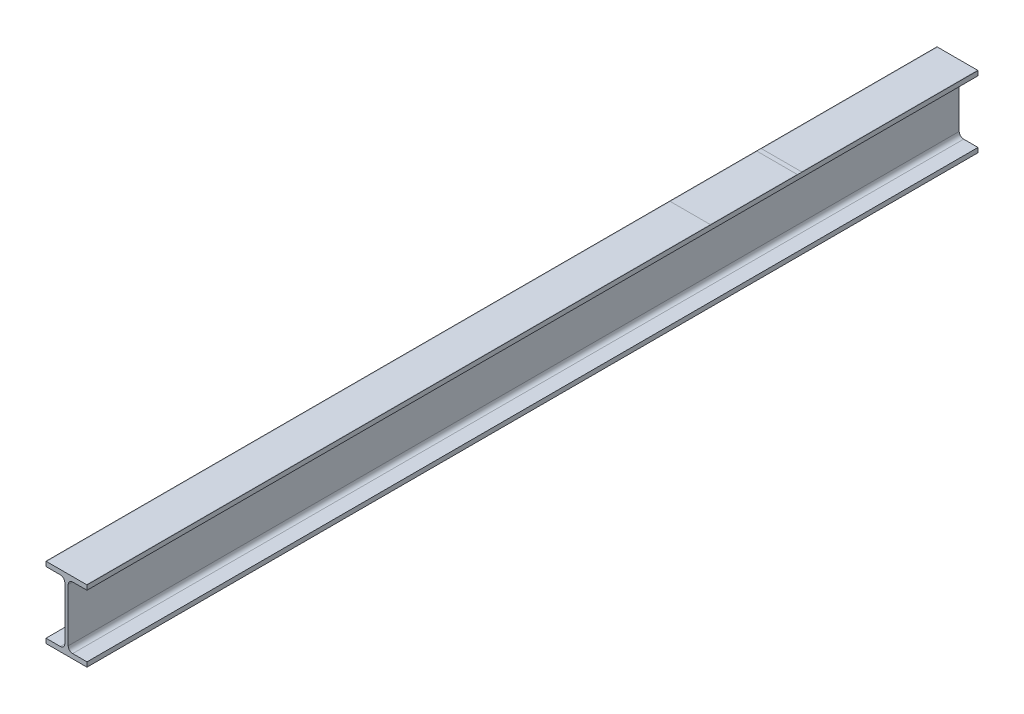
ISO-10303-21;
HEADER;
FILE_DESCRIPTION(('STEP AP214'),'2;1');
FILE_NAME('part.step','',(''),(''),'','','');
FILE_SCHEMA(('AUTOMOTIVE_DESIGN { 1 0 10303 214 1 1 1 1 }'));
ENDSEC;
DATA;
#1=APPLICATION_CONTEXT('core data for automotive mechanical design processes');
#2=APPLICATION_PROTOCOL_DEFINITION('international standard','automotive_design',2000,#1);
#3=PRODUCT_CONTEXT('',#1,'mechanical');
#4=PRODUCT('Part','Part','',(#3));
#5=PRODUCT_RELATED_PRODUCT_CATEGORY('part','',(#4));
#6=PRODUCT_DEFINITION_FORMATION('','',#4);
#7=PRODUCT_DEFINITION_CONTEXT('part definition',#1,'design');
#8=PRODUCT_DEFINITION('design','',#6,#7);
#9=PRODUCT_DEFINITION_SHAPE('','',#8);
#10=(LENGTH_UNIT() NAMED_UNIT(*) SI_UNIT(.MILLI.,.METRE.));
#11=(NAMED_UNIT(*) PLANE_ANGLE_UNIT() SI_UNIT($,.RADIAN.));
#12=(NAMED_UNIT(*) SI_UNIT($,.STERADIAN.) SOLID_ANGLE_UNIT());
#13=UNCERTAINTY_MEASURE_WITH_UNIT(LENGTH_MEASURE(1.E-05),#10,'distance_accuracy_value','');
#14=(GEOMETRIC_REPRESENTATION_CONTEXT(3) GLOBAL_UNCERTAINTY_ASSIGNED_CONTEXT((#13)) GLOBAL_UNIT_ASSIGNED_CONTEXT((#10,
#11,#12)) REPRESENTATION_CONTEXT('',''));
#15=CARTESIAN_POINT('',(0.,0.,0.));
#16=DIRECTION('',(0.,0.,1.));
#17=DIRECTION('',(1.,0.,0.));
#18=AXIS2_PLACEMENT_3D('',#15,#16,#17);
#19=CARTESIAN_POINT('',(0.,80.,1000.));
#20=DIRECTION('',(0.,-1.,0.));
#21=DIRECTION('',(1.,0.,0.));
#22=AXIS2_PLACEMENT_3D('',#19,#20,#21);
#23=PLANE('',#22);
#24=DIRECTION('',(0.,0.,1.));
#25=VECTOR('',#24,1.);
#26=CARTESIAN_POINT('',(0.499999999999973,80.,1000.));
#27=LINE('',#26,#25);
#28=CARTESIAN_POINT('',(0.499999999999973,80.,300.));
#29=VERTEX_POINT('',#28);
#30=CARTESIAN_POINT('',(0.499999999999973,80.,1000.));
#31=VERTEX_POINT('',#30);
#32=EDGE_CURVE('E13',#29,#31,#27,.T.);
#33=ORIENTED_EDGE('',*,*,#32,.F.);
#34=DIRECTION('',(-1.,0.,0.));
#35=VECTOR('',#34,1.);
#36=CARTESIAN_POINT('',(0.,80.,300.));
#37=LINE('',#36,#35);
#38=CARTESIAN_POINT('',(0.,80.,300.));
#39=VERTEX_POINT('',#38);
#40=EDGE_CURVE('E240',#29,#39,#37,.T.);
#41=ORIENTED_EDGE('',*,*,#40,.T.);
#42=DIRECTION('',(0.,0.,-1.));
#43=VECTOR('',#42,1.);
#44=CARTESIAN_POINT('',(0.,80.,1000.));
#45=LINE('',#44,#43);
#46=CARTESIAN_POINT('',(0.,80.,1000.));
#47=VERTEX_POINT('',#46);
#48=EDGE_CURVE('E433',#47,#39,#45,.T.);
#49=ORIENTED_EDGE('',*,*,#48,.F.);
#50=DIRECTION('',(-1.,0.,0.));
#51=VECTOR('',#50,1.);
#52=CARTESIAN_POINT('',(0.,80.,1000.));
#53=LINE('',#52,#51);
#54=EDGE_CURVE('E373',#31,#47,#53,.T.);
#55=ORIENTED_EDGE('',*,*,#54,.F.);
#56=EDGE_LOOP('',(#33,#41,#49,#55));
#57=FACE_BOUND('',#56,.T.);
#58=ADVANCED_FACE('F49',(#57),#23,.F.);
#59=DIRECTION('',(0.,0.,-1.));
#60=VECTOR('',#59,1.);
#61=CARTESIAN_POINT('',(45.5,80.,1000.));
#62=LINE('',#61,#60);
#63=CARTESIAN_POINT('',(45.5,80.,1000.));
#64=VERTEX_POINT('',#63);
#65=CARTESIAN_POINT('',(45.5,80.,300.));
#66=VERTEX_POINT('',#65);
#67=EDGE_CURVE('E59',#64,#66,#62,.T.);
#68=ORIENTED_EDGE('',*,*,#67,.F.);
#69=CARTESIAN_POINT('',(46.,80.,1000.));
#70=VERTEX_POINT('',#69);
#71=EDGE_CURVE('E369',#70,#64,#53,.T.);
#72=ORIENTED_EDGE('',*,*,#71,.F.);
#73=DIRECTION('',(0.,0.,-1.));
#74=VECTOR('',#73,1.);
#75=CARTESIAN_POINT('',(46.,80.,1000.));
#76=LINE('',#75,#74);
#77=CARTESIAN_POINT('',(46.,80.,300.));
#78=VERTEX_POINT('',#77);
#79=EDGE_CURVE('E422',#70,#78,#76,.T.);
#80=ORIENTED_EDGE('',*,*,#79,.T.);
#81=EDGE_CURVE('E247',#78,#66,#37,.T.);
#82=ORIENTED_EDGE('',*,*,#81,.T.);
#83=EDGE_LOOP('',(#68,#72,#80,#82));
#84=FACE_BOUND('',#83,.T.);
#85=ADVANCED_FACE('F428',(#84),#23,.F.);
#86=DIRECTION('',(0.,0.,1.));
#87=VECTOR('',#86,1.);
#88=CARTESIAN_POINT('',(0.499999999999973,80.,1000.));
#89=LINE('',#88,#87);
#90=CARTESIAN_POINT('',(0.499999999999973,80.,202.5));
#91=VERTEX_POINT('',#90);
#92=EDGE_CURVE('E262',#91,#29,#89,.T.);
#93=ORIENTED_EDGE('',*,*,#92,.F.);
#94=DIRECTION('',(1.,0.,0.));
#95=VECTOR('',#94,1.);
#96=CARTESIAN_POINT('',(0.,80.,202.5));
#97=LINE('',#96,#95);
#98=CARTESIAN_POINT('',(0.,80.,202.5));
#99=VERTEX_POINT('',#98);
#100=EDGE_CURVE('E261',#99,#91,#97,.T.);
#101=ORIENTED_EDGE('',*,*,#100,.F.);
#102=EDGE_CURVE('E436',#39,#99,#45,.T.);
#103=ORIENTED_EDGE('',*,*,#102,.F.);
#104=ORIENTED_EDGE('',*,*,#40,.F.);
#105=EDGE_LOOP('',(#93,#101,#103,#104));
#106=FACE_BOUND('',#105,.T.);
#107=ADVANCED_FACE('F517',(#106),#23,.F.);
#108=DIRECTION('',(0.,0.,-1.));
#109=VECTOR('',#108,1.);
#110=CARTESIAN_POINT('',(45.5,80.,1000.));
#111=LINE('',#110,#109);
#112=CARTESIAN_POINT('',(45.5,80.,202.5));
#113=VERTEX_POINT('',#112);
#114=EDGE_CURVE('E266',#66,#113,#111,.T.);
#115=ORIENTED_EDGE('',*,*,#114,.F.);
#116=ORIENTED_EDGE('',*,*,#81,.F.);
#117=CARTESIAN_POINT('',(46.,80.,202.5));
#118=VERTEX_POINT('',#117);
#119=EDGE_CURVE('E288',#78,#118,#76,.T.);
#120=ORIENTED_EDGE('',*,*,#119,.T.);
#121=EDGE_CURVE('E285',#113,#118,#97,.T.);
#122=ORIENTED_EDGE('',*,*,#121,.F.);
#123=EDGE_LOOP('',(#115,#116,#120,#122));
#124=FACE_BOUND('',#123,.T.);
#125=ADVANCED_FACE('F286',(#124),#23,.F.);
#126=DIRECTION('',(0.,0.,1.));
#127=VECTOR('',#126,1.);
#128=CARTESIAN_POINT('',(0.499999999999973,80.,1000.));
#129=LINE('',#128,#127);
#130=CARTESIAN_POINT('',(0.499999999999973,80.,0.));
#131=VERTEX_POINT('',#130);
#132=CARTESIAN_POINT('',(0.499999999999973,80.,197.5));
#133=VERTEX_POINT('',#132);
#134=EDGE_CURVE('E267',#131,#133,#129,.T.);
#135=ORIENTED_EDGE('',*,*,#134,.F.);
#136=DIRECTION('',(-1.,0.,0.));
#137=VECTOR('',#136,1.);
#138=CARTESIAN_POINT('',(0.,80.,0.));
#139=LINE('',#138,#137);
#140=CARTESIAN_POINT('',(0.,80.,0.));
#141=VERTEX_POINT('',#140);
#142=EDGE_CURVE('E325',#131,#141,#139,.T.);
#143=ORIENTED_EDGE('',*,*,#142,.T.);
#144=CARTESIAN_POINT('',(0.,80.,197.5));
#145=VERTEX_POINT('',#144);
#146=EDGE_CURVE('E437',#145,#141,#45,.T.);
#147=ORIENTED_EDGE('',*,*,#146,.F.);
#148=DIRECTION('',(-1.,0.,0.));
#149=VECTOR('',#148,1.);
#150=CARTESIAN_POINT('',(0.,80.,197.5));
#151=LINE('',#150,#149);
#152=EDGE_CURVE('E255',#133,#145,#151,.T.);
#153=ORIENTED_EDGE('',*,*,#152,.F.);
#154=EDGE_LOOP('',(#135,#143,#147,#153));
#155=FACE_BOUND('',#154,.T.);
#156=ADVANCED_FACE('F557',(#155),#23,.F.);
#157=DIRECTION('',(0.,0.,-1.));
#158=VECTOR('',#157,1.);
#159=CARTESIAN_POINT('',(45.5,80.,1000.));
#160=LINE('',#159,#158);
#161=CARTESIAN_POINT('',(45.5,80.,197.5));
#162=VERTEX_POINT('',#161);
#163=CARTESIAN_POINT('',(45.5000000000001,80.,0.));
#164=VERTEX_POINT('',#163);
#165=EDGE_CURVE('E53',#162,#164,#160,.T.);
#166=ORIENTED_EDGE('',*,*,#165,.F.);
#167=CARTESIAN_POINT('',(46.,80.,197.5));
#168=VERTEX_POINT('',#167);
#169=EDGE_CURVE('E256',#168,#162,#151,.T.);
#170=ORIENTED_EDGE('',*,*,#169,.F.);
#171=CARTESIAN_POINT('',(46.,80.,0.));
#172=VERTEX_POINT('',#171);
#173=EDGE_CURVE('E329',#168,#172,#76,.T.);
#174=ORIENTED_EDGE('',*,*,#173,.T.);
#175=EDGE_CURVE('E323',#172,#164,#139,.T.);
#176=ORIENTED_EDGE('',*,*,#175,.T.);
#177=EDGE_LOOP('',(#166,#170,#174,#176));
#178=FACE_BOUND('',#177,.T.);
#179=ADVANCED_FACE('F327',(#178),#23,.F.);
#180=EDGE_CURVE('E281',#91,#113,#97,.T.);
#181=ORIENTED_EDGE('',*,*,#180,.F.);
#182=ORIENTED_EDGE('',*,*,#92,.T.);
#183=EDGE_CURVE('E245',#66,#29,#37,.T.);
#184=ORIENTED_EDGE('',*,*,#183,.F.);
#185=ORIENTED_EDGE('',*,*,#114,.T.);
#186=EDGE_LOOP('',(#181,#182,#184,#185));
#187=FACE_BOUND('',#186,.T.);
#188=ADVANCED_FACE('F279',(#187),#23,.F.);
#189=EDGE_CURVE('E312',#164,#131,#139,.T.);
#190=ORIENTED_EDGE('',*,*,#189,.T.);
#191=ORIENTED_EDGE('',*,*,#134,.T.);
#192=EDGE_CURVE('E314',#162,#133,#151,.T.);
#193=ORIENTED_EDGE('',*,*,#192,.F.);
#194=ORIENTED_EDGE('',*,*,#165,.T.);
#195=EDGE_LOOP('',(#190,#191,#193,#194));
#196=FACE_BOUND('',#195,.T.);
#197=ADVANCED_FACE('F311',(#196),#23,.F.);
#198=ORIENTED_EDGE('',*,*,#183,.T.);
#199=ORIENTED_EDGE('',*,*,#32,.T.);
#200=EDGE_CURVE('E372',#64,#31,#53,.T.);
#201=ORIENTED_EDGE('',*,*,#200,.F.);
#202=ORIENTED_EDGE('',*,*,#67,.T.);
#203=EDGE_LOOP('',(#198,#199,#201,#202));
#204=FACE_BOUND('',#203,.T.);
#205=ADVANCED_FACE('F511',(#204),#23,.F.);
#206=CARTESIAN_POINT('',(46.,0.,1000.));
#207=DIRECTION('',(0.,1.,0.));
#208=DIRECTION('',(-1.,0.,0.));
#209=AXIS2_PLACEMENT_3D('',#206,#207,#208);
#210=PLANE('',#209);
#211=DIRECTION('',(1.,0.,0.));
#212=VECTOR('',#211,1.);
#213=CARTESIAN_POINT('',(46.,0.,0.));
#214=LINE('',#213,#212);
#215=CARTESIAN_POINT('',(0.,0.,0.));
#216=VERTEX_POINT('',#215);
#217=CARTESIAN_POINT('',(46.,0.,0.));
#218=VERTEX_POINT('',#217);
#219=EDGE_CURVE('E238',#216,#218,#214,.T.);
#220=ORIENTED_EDGE('',*,*,#219,.T.);
#221=DIRECTION('',(0.,0.,-1.));
#222=VECTOR('',#221,1.);
#223=CARTESIAN_POINT('',(46.,0.,1000.));
#224=LINE('',#223,#222);
#225=CARTESIAN_POINT('',(46.,0.,1000.));
#226=VERTEX_POINT('',#225);
#227=EDGE_CURVE('E219',#226,#218,#224,.T.);
#228=ORIENTED_EDGE('',*,*,#227,.F.);
#229=DIRECTION('',(1.,0.,0.));
#230=VECTOR('',#229,1.);
#231=CARTESIAN_POINT('',(46.,0.,1000.));
#232=LINE('',#231,#230);
#233=CARTESIAN_POINT('',(0.,0.,1000.));
#234=VERTEX_POINT('',#233);
#235=EDGE_CURVE('E226',#234,#226,#232,.T.);
#236=ORIENTED_EDGE('',*,*,#235,.F.);
#237=DIRECTION('',(0.,0.,-1.));
#238=VECTOR('',#237,1.);
#239=CARTESIAN_POINT('',(0.,0.,1000.));
#240=LINE('',#239,#238);
#241=EDGE_CURVE('E356',#234,#216,#240,.T.);
#242=ORIENTED_EDGE('',*,*,#241,.T.);
#243=EDGE_LOOP('',(#220,#228,#236,#242));
#244=FACE_BOUND('',#243,.T.);
#245=ADVANCED_FACE('F51',(#244),#210,.F.);
#246=CARTESIAN_POINT('',(46.,5.19999999999998,1000.));
#247=DIRECTION('',(-1.,0.,0.));
#248=DIRECTION('',(0.,0.,1.));
#249=AXIS2_PLACEMENT_3D('',#246,#247,#248);
#250=PLANE('',#249);
#251=DIRECTION('',(0.,1.,0.));
#252=VECTOR('',#251,1.);
#253=CARTESIAN_POINT('',(46.,5.19999999999998,0.));
#254=LINE('',#253,#252);
#255=CARTESIAN_POINT('',(46.,5.19999999999998,0.));
#256=VERTEX_POINT('',#255);
#257=EDGE_CURVE('E352',#218,#256,#254,.T.);
#258=ORIENTED_EDGE('',*,*,#257,.T.);
#259=DIRECTION('',(0.,0.,-1.));
#260=VECTOR('',#259,1.);
#261=CARTESIAN_POINT('',(46.,5.19999999999998,1000.));
#262=LINE('',#261,#260);
#263=CARTESIAN_POINT('',(46.,5.19999999999998,1000.));
#264=VERTEX_POINT('',#263);
#265=EDGE_CURVE('E222',#264,#256,#262,.T.);
#266=ORIENTED_EDGE('',*,*,#265,.F.);
#267=DIRECTION('',(0.,1.,0.));
#268=VECTOR('',#267,1.);
#269=CARTESIAN_POINT('',(46.,5.19999999999998,1000.));
#270=LINE('',#269,#268);
#271=EDGE_CURVE('E215',#226,#264,#270,.T.);
#272=ORIENTED_EDGE('',*,*,#271,.F.);
#273=ORIENTED_EDGE('',*,*,#227,.T.);
#274=EDGE_LOOP('',(#258,#266,#272,#273));
#275=FACE_BOUND('',#274,.T.);
#276=ADVANCED_FACE('F217',(#275),#250,.F.);
#277=CARTESIAN_POINT('',(29.9,5.19999999999998,1000.));
#278=DIRECTION('',(0.,-1.,0.));
#279=DIRECTION('',(0.,0.,-1.));
#280=AXIS2_PLACEMENT_3D('',#277,#278,#279);
#281=PLANE('',#280);
#282=DIRECTION('',(-1.,0.,0.));
#283=VECTOR('',#282,1.);
#284=CARTESIAN_POINT('',(29.9,5.19999999999998,0.));
#285=LINE('',#284,#283);
#286=CARTESIAN_POINT('',(29.9,5.19999999999999,0.));
#287=VERTEX_POINT('',#286);
#288=EDGE_CURVE('E350',#256,#287,#285,.T.);
#289=ORIENTED_EDGE('',*,*,#288,.T.);
#290=DIRECTION('',(0.,0.,-1.));
#291=VECTOR('',#290,1.);
#292=CARTESIAN_POINT('',(29.9,5.19999999999999,1000.));
#293=LINE('',#292,#291);
#294=CARTESIAN_POINT('',(29.9,5.19999999999999,1000.));
#295=VERTEX_POINT('',#294);
#296=EDGE_CURVE('E249',#295,#287,#293,.T.);
#297=ORIENTED_EDGE('',*,*,#296,.F.);
#298=DIRECTION('',(-1.,0.,0.));
#299=VECTOR('',#298,1.);
#300=CARTESIAN_POINT('',(29.9,5.19999999999998,1000.));
#301=LINE('',#300,#299);
#302=EDGE_CURVE('E225',#264,#295,#301,.T.);
#303=ORIENTED_EDGE('',*,*,#302,.F.);
#304=ORIENTED_EDGE('',*,*,#265,.T.);
#305=EDGE_LOOP('',(#289,#297,#303,#304));
#306=FACE_BOUND('',#305,.T.);
#307=ADVANCED_FACE('F389',(#306),#281,.F.);
#308=CARTESIAN_POINT('',(29.9,10.2,1000.));
#309=DIRECTION('',(0.,0.,-1.));
#310=DIRECTION('',(-1.,0.,0.));
#311=AXIS2_PLACEMENT_3D('',#308,#309,#310);
#312=CYLINDRICAL_SURFACE('',#311,5.);
#313=CARTESIAN_POINT('',(29.9,10.2,0.));
#314=DIRECTION('',(0.,0.,-1.));
#315=DIRECTION('',(1.,0.,0.));
#316=AXIS2_PLACEMENT_3D('',#313,#314,#315);
#317=CIRCLE('',#316,5.);
#318=CARTESIAN_POINT('',(24.9,10.2,0.));
#319=VERTEX_POINT('',#318);
#320=EDGE_CURVE('E348',#287,#319,#317,.T.);
#321=ORIENTED_EDGE('',*,*,#320,.T.);
#322=DIRECTION('',(0.,0.,-1.));
#323=VECTOR('',#322,1.);
#324=CARTESIAN_POINT('',(24.9,10.2,1000.));
#325=LINE('',#324,#323);
#326=CARTESIAN_POINT('',(24.9,10.2,1000.));
#327=VERTEX_POINT('',#326);
#328=EDGE_CURVE('E393',#327,#319,#325,.T.);
#329=ORIENTED_EDGE('',*,*,#328,.F.);
#330=CARTESIAN_POINT('',(29.9,10.2,1000.));
#331=DIRECTION('',(0.,0.,-1.));
#332=DIRECTION('',(1.,0.,0.));
#333=AXIS2_PLACEMENT_3D('',#330,#331,#332);
#334=CIRCLE('',#333,5.);
#335=EDGE_CURVE('E382',#295,#327,#334,.T.);
#336=ORIENTED_EDGE('',*,*,#335,.F.);
#337=ORIENTED_EDGE('',*,*,#296,.T.);
#338=EDGE_LOOP('',(#321,#329,#336,#337));
#339=FACE_BOUND('',#338,.T.);
#340=ADVANCED_FACE('F394',(#339),#312,.F.);
#341=CARTESIAN_POINT('',(24.9,69.8,1000.));
#342=DIRECTION('',(-1.,0.,0.));
#343=DIRECTION('',(0.,0.,1.));
#344=AXIS2_PLACEMENT_3D('',#341,#342,#343);
#345=PLANE('',#344);
#346=DIRECTION('',(0.,1.,0.));
#347=VECTOR('',#346,1.);
#348=CARTESIAN_POINT('',(24.9,69.8,0.));
#349=LINE('',#348,#347);
#350=CARTESIAN_POINT('',(24.9,69.8,0.));
#351=VERTEX_POINT('',#350);
#352=EDGE_CURVE('E346',#319,#351,#349,.T.);
#353=ORIENTED_EDGE('',*,*,#352,.T.);
#354=DIRECTION('',(0.,0.,-1.));
#355=VECTOR('',#354,1.);
#356=CARTESIAN_POINT('',(24.9,69.8,1000.));
#357=LINE('',#356,#355);
#358=CARTESIAN_POINT('',(24.9,69.8,1000.));
#359=VERTEX_POINT('',#358);
#360=EDGE_CURVE('E400',#359,#351,#357,.T.);
#361=ORIENTED_EDGE('',*,*,#360,.F.);
#362=DIRECTION('',(0.,1.,0.));
#363=VECTOR('',#362,1.);
#364=CARTESIAN_POINT('',(24.9,69.8,1000.));
#365=LINE('',#364,#363);
#366=EDGE_CURVE('E380',#327,#359,#365,.T.);
#367=ORIENTED_EDGE('',*,*,#366,.F.);
#368=ORIENTED_EDGE('',*,*,#328,.T.);
#369=EDGE_LOOP('',(#353,#361,#367,#368));
#370=FACE_BOUND('',#369,.T.);
#371=ADVANCED_FACE('F403',(#370),#345,.F.);
#372=CARTESIAN_POINT('',(29.9,69.8,1000.));
#373=DIRECTION('',(0.,0.,-1.));
#374=DIRECTION('',(-1.,0.,0.));
#375=AXIS2_PLACEMENT_3D('',#372,#373,#374);
#376=CYLINDRICAL_SURFACE('',#375,5.);
#377=CARTESIAN_POINT('',(29.9,69.8,0.));
#378=DIRECTION('',(0.,0.,-1.));
#379=DIRECTION('',(1.,0.,0.));
#380=AXIS2_PLACEMENT_3D('',#377,#378,#379);
#381=CIRCLE('',#380,5.);
#382=CARTESIAN_POINT('',(29.9,74.8,0.));
#383=VERTEX_POINT('',#382);
#384=EDGE_CURVE('E342',#351,#383,#381,.T.);
#385=ORIENTED_EDGE('',*,*,#384,.T.);
#386=DIRECTION('',(0.,0.,-1.));
#387=VECTOR('',#386,1.);
#388=CARTESIAN_POINT('',(29.9,74.8,1000.));
#389=LINE('',#388,#387);
#390=CARTESIAN_POINT('',(29.9,74.8,1000.));
#391=VERTEX_POINT('',#390);
#392=EDGE_CURVE('E411',#391,#383,#389,.T.);
#393=ORIENTED_EDGE('',*,*,#392,.F.);
#394=CARTESIAN_POINT('',(29.9,69.8,1000.));
#395=DIRECTION('',(0.,0.,-1.));
#396=DIRECTION('',(1.,0.,0.));
#397=AXIS2_PLACEMENT_3D('',#394,#395,#396);
#398=CIRCLE('',#397,5.);
#399=EDGE_CURVE('E378',#359,#391,#398,.T.);
#400=ORIENTED_EDGE('',*,*,#399,.F.);
#401=ORIENTED_EDGE('',*,*,#360,.T.);
#402=EDGE_LOOP('',(#385,#393,#400,#401));
#403=FACE_BOUND('',#402,.T.);
#404=ADVANCED_FACE('F412',(#403),#376,.F.);
#405=CARTESIAN_POINT('',(46.,74.8,1000.));
#406=DIRECTION('',(0.,1.,0.));
#407=DIRECTION('',(0.,0.,1.));
#408=AXIS2_PLACEMENT_3D('',#405,#406,#407);
#409=PLANE('',#408);
#410=DIRECTION('',(1.,0.,0.));
#411=VECTOR('',#410,1.);
#412=CARTESIAN_POINT('',(46.,74.8,0.));
#413=LINE('',#412,#411);
#414=CARTESIAN_POINT('',(46.,74.8,0.));
#415=VERTEX_POINT('',#414);
#416=EDGE_CURVE('E339',#383,#415,#413,.T.);
#417=ORIENTED_EDGE('',*,*,#416,.T.);
#418=DIRECTION('',(0.,0.,-1.));
#419=VECTOR('',#418,1.);
#420=CARTESIAN_POINT('',(46.,74.8,1000.));
#421=LINE('',#420,#419);
#422=CARTESIAN_POINT('',(46.,74.8,1000.));
#423=VERTEX_POINT('',#422);
#424=EDGE_CURVE('E417',#423,#415,#421,.T.);
#425=ORIENTED_EDGE('',*,*,#424,.F.);
#426=DIRECTION('',(1.,0.,0.));
#427=VECTOR('',#426,1.);
#428=CARTESIAN_POINT('',(46.,74.8,1000.));
#429=LINE('',#428,#427);
#430=EDGE_CURVE('E376',#391,#423,#429,.T.);
#431=ORIENTED_EDGE('',*,*,#430,.F.);
#432=ORIENTED_EDGE('',*,*,#392,.T.);
#433=EDGE_LOOP('',(#417,#425,#431,#432));
#434=FACE_BOUND('',#433,.T.);
#435=ADVANCED_FACE('F419',(#434),#409,.F.);
#436=CARTESIAN_POINT('',(46.,80.,1000.));
#437=DIRECTION('',(-1.,0.,0.));
#438=DIRECTION('',(0.,-1.,0.));
#439=AXIS2_PLACEMENT_3D('',#436,#437,#438);
#440=PLANE('',#439);
#441=DIRECTION('',(0.,1.,0.));
#442=VECTOR('',#441,1.);
#443=CARTESIAN_POINT('',(46.,80.,0.));
#444=LINE('',#443,#442);
#445=EDGE_CURVE('E335',#415,#172,#444,.T.);
#446=ORIENTED_EDGE('',*,*,#445,.T.);
#447=ORIENTED_EDGE('',*,*,#173,.F.);
#448=EDGE_CURVE('E431',#118,#168,#76,.T.);
#449=ORIENTED_EDGE('',*,*,#448,.F.);
#450=ORIENTED_EDGE('',*,*,#119,.F.);
#451=ORIENTED_EDGE('',*,*,#79,.F.);
#452=DIRECTION('',(0.,1.,0.));
#453=VECTOR('',#452,1.);
#454=CARTESIAN_POINT('',(46.,80.,1000.));
#455=LINE('',#454,#453);
#456=EDGE_CURVE('E374',#423,#70,#455,.T.);
#457=ORIENTED_EDGE('',*,*,#456,.F.);
#458=ORIENTED_EDGE('',*,*,#424,.T.);
#459=EDGE_LOOP('',(#446,#447,#449,#450,#451,#457,#458));
#460=FACE_BOUND('',#459,.T.);
#461=ADVANCED_FACE('F425',(#460),#440,.F.);
#462=EDGE_CURVE('E443',#99,#145,#45,.T.);
#463=ORIENTED_EDGE('',*,*,#462,.F.);
#464=ORIENTED_EDGE('',*,*,#100,.T.);
#465=ORIENTED_EDGE('',*,*,#180,.T.);
#466=ORIENTED_EDGE('',*,*,#121,.T.);
#467=ORIENTED_EDGE('',*,*,#448,.T.);
#468=ORIENTED_EDGE('',*,*,#169,.T.);
#469=ORIENTED_EDGE('',*,*,#192,.T.);
#470=ORIENTED_EDGE('',*,*,#152,.T.);
#471=EDGE_LOOP('',(#463,#464,#465,#466,#467,#468,#469,#470));
#472=FACE_BOUND('',#471,.T.);
#473=ADVANCED_FACE('F294',(#472),#23,.F.);
#474=CARTESIAN_POINT('',(0.,74.8,1000.));
#475=DIRECTION('',(1.,0.,0.));
#476=DIRECTION('',(0.,1.,0.));
#477=AXIS2_PLACEMENT_3D('',#474,#475,#476);
#478=PLANE('',#477);
#479=DIRECTION('',(0.,-1.,0.));
#480=VECTOR('',#479,1.);
#481=CARTESIAN_POINT('',(0.,74.8,0.));
#482=LINE('',#481,#480);
#483=CARTESIAN_POINT('',(0.,74.8,0.));
#484=VERTEX_POINT('',#483);
#485=EDGE_CURVE('E331',#141,#484,#482,.T.);
#486=ORIENTED_EDGE('',*,*,#485,.T.);
#487=DIRECTION('',(0.,0.,-1.));
#488=VECTOR('',#487,1.);
#489=CARTESIAN_POINT('',(0.,74.8,1000.));
#490=LINE('',#489,#488);
#491=CARTESIAN_POINT('',(0.,74.8,1000.));
#492=VERTEX_POINT('',#491);
#493=EDGE_CURVE('E445',#492,#484,#490,.T.);
#494=ORIENTED_EDGE('',*,*,#493,.F.);
#495=DIRECTION('',(0.,-1.,0.));
#496=VECTOR('',#495,1.);
#497=CARTESIAN_POINT('',(0.,74.8,1000.));
#498=LINE('',#497,#496);
#499=EDGE_CURVE('E367',#47,#492,#498,.T.);
#500=ORIENTED_EDGE('',*,*,#499,.F.);
#501=ORIENTED_EDGE('',*,*,#48,.T.);
#502=ORIENTED_EDGE('',*,*,#102,.T.);
#503=ORIENTED_EDGE('',*,*,#462,.T.);
#504=ORIENTED_EDGE('',*,*,#146,.T.);
#505=EDGE_LOOP('',(#486,#494,#500,#501,#502,#503,#504));
#506=FACE_BOUND('',#505,.T.);
#507=ADVANCED_FACE('F502',(#506),#478,.F.);
#508=CARTESIAN_POINT('',(16.1,74.8,1000.));
#509=DIRECTION('',(0.,1.,0.));
#510=DIRECTION('',(-1.,0.,0.));
#511=AXIS2_PLACEMENT_3D('',#508,#509,#510);
#512=PLANE('',#511);
#513=DIRECTION('',(1.,0.,0.));
#514=VECTOR('',#513,1.);
#515=CARTESIAN_POINT('',(16.1,74.8,0.));
#516=LINE('',#515,#514);
#517=CARTESIAN_POINT('',(16.1,74.8,0.));
#518=VERTEX_POINT('',#517);
#519=EDGE_CURVE('E332',#484,#518,#516,.T.);
#520=ORIENTED_EDGE('',*,*,#519,.T.);
#521=DIRECTION('',(0.,0.,-1.));
#522=VECTOR('',#521,1.);
#523=CARTESIAN_POINT('',(16.1,74.8,1000.));
#524=LINE('',#523,#522);
#525=CARTESIAN_POINT('',(16.1,74.8,1000.));
#526=VERTEX_POINT('',#525);
#527=EDGE_CURVE('E449',#526,#518,#524,.T.);
#528=ORIENTED_EDGE('',*,*,#527,.F.);
#529=DIRECTION('',(1.,0.,0.));
#530=VECTOR('',#529,1.);
#531=CARTESIAN_POINT('',(16.1,74.8,1000.));
#532=LINE('',#531,#530);
#533=EDGE_CURVE('E365',#492,#526,#532,.T.);
#534=ORIENTED_EDGE('',*,*,#533,.F.);
#535=ORIENTED_EDGE('',*,*,#493,.T.);
#536=EDGE_LOOP('',(#520,#528,#534,#535));
#537=FACE_BOUND('',#536,.T.);
#538=ADVANCED_FACE('F483',(#537),#512,.F.);
#539=CARTESIAN_POINT('',(16.1,69.8,1000.));
#540=DIRECTION('',(0.,0.,-1.));
#541=DIRECTION('',(-1.,0.,0.));
#542=AXIS2_PLACEMENT_3D('',#539,#540,#541);
#543=CYLINDRICAL_SURFACE('',#542,5.);
#544=CARTESIAN_POINT('',(16.1,69.8,0.));
#545=DIRECTION('',(0.,0.,-1.));
#546=DIRECTION('',(1.,0.,0.));
#547=AXIS2_PLACEMENT_3D('',#544,#545,#546);
#548=CIRCLE('',#547,5.);
#549=CARTESIAN_POINT('',(21.1,69.8,0.));
#550=VERTEX_POINT('',#549);
#551=EDGE_CURVE('E480',#518,#550,#548,.T.);
#552=ORIENTED_EDGE('',*,*,#551,.T.);
#553=DIRECTION('',(0.,0.,-1.));
#554=VECTOR('',#553,1.);
#555=CARTESIAN_POINT('',(21.1,69.8,1000.));
#556=LINE('',#555,#554);
#557=CARTESIAN_POINT('',(21.1,69.8,1000.));
#558=VERTEX_POINT('',#557);
#559=EDGE_CURVE('E456',#558,#550,#556,.T.);
#560=ORIENTED_EDGE('',*,*,#559,.F.);
#561=CARTESIAN_POINT('',(16.1,69.8,1000.));
#562=DIRECTION('',(0.,0.,-1.));
#563=DIRECTION('',(1.,0.,0.));
#564=AXIS2_PLACEMENT_3D('',#561,#562,#563);
#565=CIRCLE('',#564,5.);
#566=EDGE_CURVE('E363',#526,#558,#565,.T.);
#567=ORIENTED_EDGE('',*,*,#566,.F.);
#568=ORIENTED_EDGE('',*,*,#527,.T.);
#569=EDGE_LOOP('',(#552,#560,#567,#568));
#570=FACE_BOUND('',#569,.T.);
#571=ADVANCED_FACE('F487',(#570),#543,.F.);
#572=CARTESIAN_POINT('',(21.1,10.2,1000.));
#573=DIRECTION('',(1.,0.,0.));
#574=DIRECTION('',(0.,1.,0.));
#575=AXIS2_PLACEMENT_3D('',#572,#573,#574);
#576=PLANE('',#575);
#577=DIRECTION('',(0.,-1.,0.));
#578=VECTOR('',#577,1.);
#579=CARTESIAN_POINT('',(21.1,10.2,0.));
#580=LINE('',#579,#578);
#581=CARTESIAN_POINT('',(21.1,10.2,0.));
#582=VERTEX_POINT('',#581);
#583=EDGE_CURVE('E478',#550,#582,#580,.T.);
#584=ORIENTED_EDGE('',*,*,#583,.T.);
#585=DIRECTION('',(0.,0.,-1.));
#586=VECTOR('',#585,1.);
#587=CARTESIAN_POINT('',(21.1,10.2,1000.));
#588=LINE('',#587,#586);
#589=CARTESIAN_POINT('',(21.1,10.2,1000.));
#590=VERTEX_POINT('',#589);
#591=EDGE_CURVE('E462',#590,#582,#588,.T.);
#592=ORIENTED_EDGE('',*,*,#591,.F.);
#593=DIRECTION('',(0.,-1.,0.));
#594=VECTOR('',#593,1.);
#595=CARTESIAN_POINT('',(21.1,10.2,1000.));
#596=LINE('',#595,#594);
#597=EDGE_CURVE('E361',#558,#590,#596,.T.);
#598=ORIENTED_EDGE('',*,*,#597,.F.);
#599=ORIENTED_EDGE('',*,*,#559,.T.);
#600=EDGE_LOOP('',(#584,#592,#598,#599));
#601=FACE_BOUND('',#600,.T.);
#602=ADVANCED_FACE('F494',(#601),#576,.F.);
#603=CARTESIAN_POINT('',(16.1,10.2,1000.));
#604=DIRECTION('',(0.,0.,-1.));
#605=DIRECTION('',(-1.,0.,0.));
#606=AXIS2_PLACEMENT_3D('',#603,#604,#605);
#607=CYLINDRICAL_SURFACE('',#606,5.);
#608=CARTESIAN_POINT('',(16.1,10.2,0.));
#609=DIRECTION('',(0.,0.,-1.));
#610=DIRECTION('',(1.,0.,0.));
#611=AXIS2_PLACEMENT_3D('',#608,#609,#610);
#612=CIRCLE('',#611,5.);
#613=CARTESIAN_POINT('',(16.1,5.19999999999998,0.));
#614=VERTEX_POINT('',#613);
#615=EDGE_CURVE('E476',#582,#614,#612,.T.);
#616=ORIENTED_EDGE('',*,*,#615,.T.);
#617=DIRECTION('',(0.,0.,-1.));
#618=VECTOR('',#617,1.);
#619=CARTESIAN_POINT('',(16.1,5.19999999999998,1000.));
#620=LINE('',#619,#618);
#621=CARTESIAN_POINT('',(16.1,5.19999999999998,1000.));
#622=VERTEX_POINT('',#621);
#623=EDGE_CURVE('E466',#622,#614,#620,.T.);
#624=ORIENTED_EDGE('',*,*,#623,.F.);
#625=CARTESIAN_POINT('',(16.1,10.2,1000.));
#626=DIRECTION('',(0.,0.,-1.));
#627=DIRECTION('',(1.,0.,0.));
#628=AXIS2_PLACEMENT_3D('',#625,#626,#627);
#629=CIRCLE('',#628,5.);
#630=EDGE_CURVE('E359',#590,#622,#629,.T.);
#631=ORIENTED_EDGE('',*,*,#630,.F.);
#632=ORIENTED_EDGE('',*,*,#591,.T.);
#633=EDGE_LOOP('',(#616,#624,#631,#632));
#634=FACE_BOUND('',#633,.T.);
#635=ADVANCED_FACE('F498',(#634),#607,.F.);
#636=CARTESIAN_POINT('',(0.,5.19999999999998,1000.));
#637=DIRECTION('',(0.,-1.,0.));
#638=DIRECTION('',(0.,0.,-1.));
#639=AXIS2_PLACEMENT_3D('',#636,#637,#638);
#640=PLANE('',#639);
#641=DIRECTION('',(-1.,0.,0.));
#642=VECTOR('',#641,1.);
#643=CARTESIAN_POINT('',(0.,5.19999999999998,0.));
#644=LINE('',#643,#642);
#645=CARTESIAN_POINT('',(0.,5.19999999999998,0.));
#646=VERTEX_POINT('',#645);
#647=EDGE_CURVE('E474',#614,#646,#644,.T.);
#648=ORIENTED_EDGE('',*,*,#647,.T.);
#649=DIRECTION('',(0.,0.,-1.));
#650=VECTOR('',#649,1.);
#651=CARTESIAN_POINT('',(0.,5.19999999999998,1000.));
#652=LINE('',#651,#650);
#653=CARTESIAN_POINT('',(0.,5.19999999999998,1000.));
#654=VERTEX_POINT('',#653);
#655=EDGE_CURVE('E469',#654,#646,#652,.T.);
#656=ORIENTED_EDGE('',*,*,#655,.F.);
#657=DIRECTION('',(-1.,0.,0.));
#658=VECTOR('',#657,1.);
#659=CARTESIAN_POINT('',(0.,5.19999999999998,1000.));
#660=LINE('',#659,#658);
#661=EDGE_CURVE('E357',#622,#654,#660,.T.);
#662=ORIENTED_EDGE('',*,*,#661,.F.);
#663=ORIENTED_EDGE('',*,*,#623,.T.);
#664=EDGE_LOOP('',(#648,#656,#662,#663));
#665=FACE_BOUND('',#664,.T.);
#666=ADVANCED_FACE('F644',(#665),#640,.F.);
#667=CARTESIAN_POINT('',(0.,0.,1000.));
#668=DIRECTION('',(1.,0.,0.));
#669=DIRECTION('',(0.,1.,0.));
#670=AXIS2_PLACEMENT_3D('',#667,#668,#669);
#671=PLANE('',#670);
#672=DIRECTION('',(0.,-1.,0.));
#673=VECTOR('',#672,1.);
#674=CARTESIAN_POINT('',(0.,0.,0.));
#675=LINE('',#674,#673);
#676=EDGE_CURVE('E235',#646,#216,#675,.T.);
#677=ORIENTED_EDGE('',*,*,#676,.T.);
#678=ORIENTED_EDGE('',*,*,#241,.F.);
#679=DIRECTION('',(0.,-1.,0.));
#680=VECTOR('',#679,1.);
#681=CARTESIAN_POINT('',(0.,0.,1000.));
#682=LINE('',#681,#680);
#683=EDGE_CURVE('E231',#654,#234,#682,.T.);
#684=ORIENTED_EDGE('',*,*,#683,.F.);
#685=ORIENTED_EDGE('',*,*,#655,.T.);
#686=EDGE_LOOP('',(#677,#678,#684,#685));
#687=FACE_BOUND('',#686,.T.);
#688=ADVANCED_FACE('F626',(#687),#671,.F.);
#689=CARTESIAN_POINT('',(16.1,10.2,1000.));
#690=DIRECTION('',(0.,0.,1.));
#691=DIRECTION('',(1.,0.,0.));
#692=AXIS2_PLACEMENT_3D('',#689,#690,#691);
#693=PLANE('',#692);
#694=ORIENTED_EDGE('',*,*,#235,.T.);
#695=ORIENTED_EDGE('',*,*,#271,.T.);
#696=ORIENTED_EDGE('',*,*,#302,.T.);
#697=ORIENTED_EDGE('',*,*,#335,.T.);
#698=ORIENTED_EDGE('',*,*,#366,.T.);
#699=ORIENTED_EDGE('',*,*,#399,.T.);
#700=ORIENTED_EDGE('',*,*,#430,.T.);
#701=ORIENTED_EDGE('',*,*,#456,.T.);
#702=ORIENTED_EDGE('',*,*,#71,.T.);
#703=ORIENTED_EDGE('',*,*,#200,.T.);
#704=ORIENTED_EDGE('',*,*,#54,.T.);
#705=ORIENTED_EDGE('',*,*,#499,.T.);
#706=ORIENTED_EDGE('',*,*,#533,.T.);
#707=ORIENTED_EDGE('',*,*,#566,.T.);
#708=ORIENTED_EDGE('',*,*,#597,.T.);
#709=ORIENTED_EDGE('',*,*,#630,.T.);
#710=ORIENTED_EDGE('',*,*,#661,.T.);
#711=ORIENTED_EDGE('',*,*,#683,.T.);
#712=EDGE_LOOP('',(#694,#695,#696,#697,#698,#699,#700,#701,#702,#703,#704,#705,#706,#707,#708,
#709,#710,#711));
#713=FACE_BOUND('',#712,.T.);
#714=ADVANCED_FACE('F229',(#713),#693,.T.);
#715=CARTESIAN_POINT('',(16.1,10.2,0.));
#716=DIRECTION('',(0.,0.,1.));
#717=DIRECTION('',(1.,0.,0.));
#718=AXIS2_PLACEMENT_3D('',#715,#716,#717);
#719=PLANE('',#718);
#720=ORIENTED_EDGE('',*,*,#219,.F.);
#721=ORIENTED_EDGE('',*,*,#676,.F.);
#722=ORIENTED_EDGE('',*,*,#647,.F.);
#723=ORIENTED_EDGE('',*,*,#615,.F.);
#724=ORIENTED_EDGE('',*,*,#583,.F.);
#725=ORIENTED_EDGE('',*,*,#551,.F.);
#726=ORIENTED_EDGE('',*,*,#519,.F.);
#727=ORIENTED_EDGE('',*,*,#485,.F.);
#728=ORIENTED_EDGE('',*,*,#142,.F.);
#729=ORIENTED_EDGE('',*,*,#189,.F.);
#730=ORIENTED_EDGE('',*,*,#175,.F.);
#731=ORIENTED_EDGE('',*,*,#445,.F.);
#732=ORIENTED_EDGE('',*,*,#416,.F.);
#733=ORIENTED_EDGE('',*,*,#384,.F.);
#734=ORIENTED_EDGE('',*,*,#352,.F.);
#735=ORIENTED_EDGE('',*,*,#320,.F.);
#736=ORIENTED_EDGE('',*,*,#288,.F.);
#737=ORIENTED_EDGE('',*,*,#257,.F.);
#738=EDGE_LOOP('',(#720,#721,#722,#723,#724,#725,#726,#727,#728,#729,#730,#731,#732,#733,#734,
#735,#736,#737));
#739=FACE_BOUND('',#738,.T.);
#740=ADVANCED_FACE('F321',(#739),#719,.F.);
#741=CLOSED_SHELL('',(#58,#85,#107,#125,#156,#179,#188,#197,#205,#245,#276,#307,#340,#371,#404,
#435,#461,#473,#507,#538,#571,#602,#635,#666,#688,#714,#740));
#742=MANIFOLD_SOLID_BREP('B2',#741);
#743=ADVANCED_BREP_SHAPE_REPRESENTATION('',(#18,#742),#14);
#744=SHAPE_DEFINITION_REPRESENTATION(#9,#743);
ENDSEC;
END-ISO-10303-21;
